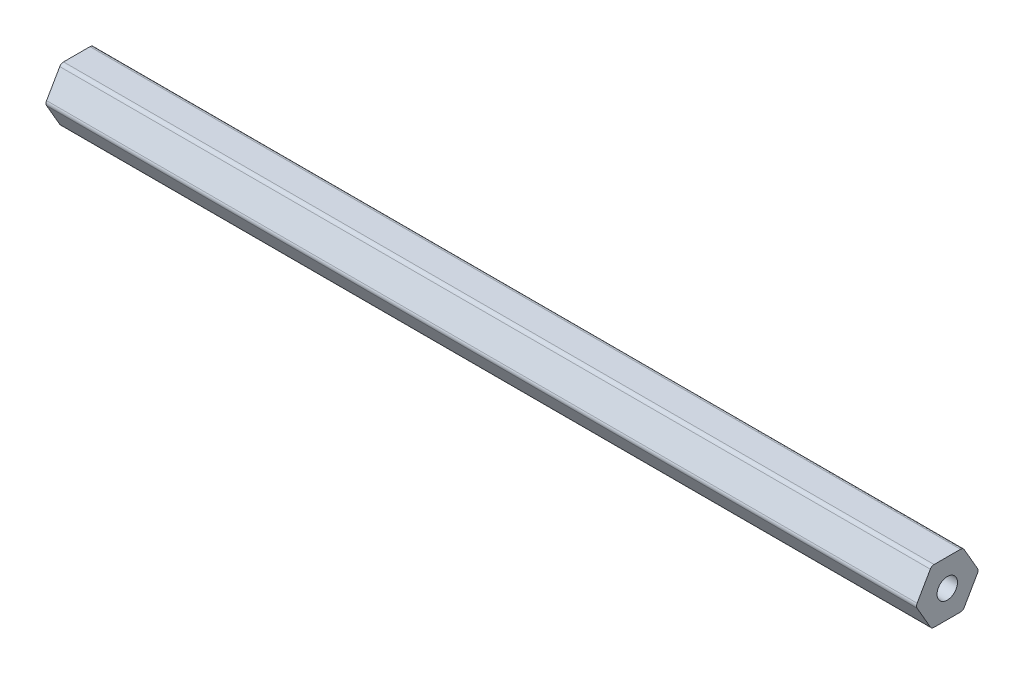
ISO-10303-21;
HEADER;
FILE_DESCRIPTION(('STEP AP214'),'2;1');
FILE_NAME('part.step','',(''),(''),'','','');
FILE_SCHEMA(('AUTOMOTIVE_DESIGN { 1 0 10303 214 1 1 1 1 }'));
ENDSEC;
DATA;
#1=APPLICATION_CONTEXT('core data for automotive mechanical design processes');
#2=APPLICATION_PROTOCOL_DEFINITION('international standard','automotive_design',2000,#1);
#3=PRODUCT_CONTEXT('',#1,'mechanical');
#4=PRODUCT('Part','Part','',(#3));
#5=PRODUCT_RELATED_PRODUCT_CATEGORY('part','',(#4));
#6=PRODUCT_DEFINITION_FORMATION('','',#4);
#7=PRODUCT_DEFINITION_CONTEXT('part definition',#1,'design');
#8=PRODUCT_DEFINITION('design','',#6,#7);
#9=PRODUCT_DEFINITION_SHAPE('','',#8);
#10=(LENGTH_UNIT() NAMED_UNIT(*) SI_UNIT(.MILLI.,.METRE.));
#11=(NAMED_UNIT(*) PLANE_ANGLE_UNIT() SI_UNIT($,.RADIAN.));
#12=(NAMED_UNIT(*) SI_UNIT($,.STERADIAN.) SOLID_ANGLE_UNIT());
#13=UNCERTAINTY_MEASURE_WITH_UNIT(LENGTH_MEASURE(1.E-05),#10,'distance_accuracy_value','');
#14=(GEOMETRIC_REPRESENTATION_CONTEXT(3) GLOBAL_UNCERTAINTY_ASSIGNED_CONTEXT((#13)) GLOBAL_UNIT_ASSIGNED_CONTEXT((#10,
#11,#12)) REPRESENTATION_CONTEXT('',''));
#15=CARTESIAN_POINT('',(0.,0.,0.));
#16=DIRECTION('',(0.,0.,1.));
#17=DIRECTION('',(1.,0.,0.));
#18=AXIS2_PLACEMENT_3D('',#15,#16,#17);
#19=CARTESIAN_POINT('',(203.2,5.334,-3.07958633585748));
#20=DIRECTION('',(-1.,0.,0.));
#21=DIRECTION('',(0.,0.,1.));
#22=AXIS2_PLACEMENT_3D('',#19,#20,#21);
#23=PLANE('',#22);
#24=CARTESIAN_POINT('',(203.2,5.334,-3.07958633585748));
#25=DIRECTION('',(1.,0.,0.));
#26=DIRECTION('',(0.,0.,1.));
#27=AXIS2_PLACEMENT_3D('',#24,#25,#26);
#28=CIRCLE('',#27,1.016);
#29=CARTESIAN_POINT('',(203.2,5.84199999999999,-3.95946814610247));
#30=VERTEX_POINT('',#29);
#31=CARTESIAN_POINT('',(203.2,6.34999999999999,-3.07958633585748));
#32=VERTEX_POINT('',#31);
#33=EDGE_CURVE('E206',#30,#32,#28,.T.);
#34=ORIENTED_EDGE('',*,*,#33,.T.);
#35=DIRECTION('',(0.,0.,1.));
#36=VECTOR('',#35,1.);
#37=CARTESIAN_POINT('',(203.2,6.34999999999999,-3.07958633585748));
#38=LINE('',#37,#36);
#39=CARTESIAN_POINT('',(203.2,6.35000000000001,3.07958633585745));
#40=VERTEX_POINT('',#39);
#41=EDGE_CURVE('E118',#32,#40,#38,.T.);
#42=ORIENTED_EDGE('',*,*,#41,.T.);
#43=CARTESIAN_POINT('',(203.2,5.33400000000001,3.07958633585745));
#44=DIRECTION('',(1.,0.,0.));
#45=DIRECTION('',(0.,0.,1.));
#46=AXIS2_PLACEMENT_3D('',#43,#44,#45);
#47=CIRCLE('',#46,1.016);
#48=CARTESIAN_POINT('',(203.2,5.84200000000001,3.95946814610244));
#49=VERTEX_POINT('',#48);
#50=EDGE_CURVE('E243',#40,#49,#47,.T.);
#51=ORIENTED_EDGE('',*,*,#50,.T.);
#52=DIRECTION('',(0.,-0.866025403784437,0.500000000000003));
#53=VECTOR('',#52,1.);
#54=CARTESIAN_POINT('',(203.2,5.84200000000001,3.95946814610244));
#55=LINE('',#54,#53);
#56=CARTESIAN_POINT('',(203.2,0.508000000000022,7.03905448195992));
#57=VERTEX_POINT('',#56);
#58=EDGE_CURVE('E263',#49,#57,#55,.T.);
#59=ORIENTED_EDGE('',*,*,#58,.T.);
#60=CARTESIAN_POINT('',(203.2,0.,6.15917267171493));
#61=DIRECTION('',(1.,0.,0.));
#62=DIRECTION('',(0.,0.,1.));
#63=AXIS2_PLACEMENT_3D('',#60,#61,#62);
#64=CIRCLE('',#63,1.016);
#65=CARTESIAN_POINT('',(203.2,-0.50799999999998,7.03905448195993));
#66=VERTEX_POINT('',#65);
#67=EDGE_CURVE('E259',#57,#66,#64,.T.);
#68=ORIENTED_EDGE('',*,*,#67,.T.);
#69=DIRECTION('',(0.,-0.86602540378444,-0.499999999999998));
#70=VECTOR('',#69,1.);
#71=CARTESIAN_POINT('',(203.2,-0.507999999999979,7.03905448195992));
#72=LINE('',#71,#70);
#73=CARTESIAN_POINT('',(203.2,-5.84199999999999,3.95946814610247));
#74=VERTEX_POINT('',#73);
#75=EDGE_CURVE('E262',#66,#74,#72,.T.);
#76=ORIENTED_EDGE('',*,*,#75,.T.);
#77=CARTESIAN_POINT('',(203.2,-5.334,3.07958633585748));
#78=DIRECTION('',(1.,0.,0.));
#79=DIRECTION('',(0.,0.,1.));
#80=AXIS2_PLACEMENT_3D('',#77,#78,#79);
#81=CIRCLE('',#80,1.016);
#82=CARTESIAN_POINT('',(203.2,-6.35,3.07958633585748));
#83=VERTEX_POINT('',#82);
#84=EDGE_CURVE('E267',#74,#83,#81,.T.);
#85=ORIENTED_EDGE('',*,*,#84,.T.);
#86=DIRECTION('',(0.,0.,-1.));
#87=VECTOR('',#86,1.);
#88=CARTESIAN_POINT('',(203.2,-6.35,3.07958633585748));
#89=LINE('',#88,#87);
#90=CARTESIAN_POINT('',(203.2,-6.35000000000001,-3.07958633585745));
#91=VERTEX_POINT('',#90);
#92=EDGE_CURVE('E274',#83,#91,#89,.T.);
#93=ORIENTED_EDGE('',*,*,#92,.T.);
#94=CARTESIAN_POINT('',(203.2,-5.33400000000001,-3.07958633585745));
#95=DIRECTION('',(1.,0.,0.));
#96=DIRECTION('',(0.,0.,1.));
#97=AXIS2_PLACEMENT_3D('',#94,#95,#96);
#98=CIRCLE('',#97,1.016);
#99=CARTESIAN_POINT('',(203.2,-5.84200000000001,-3.95946814610244));
#100=VERTEX_POINT('',#99);
#101=EDGE_CURVE('E149',#91,#100,#98,.T.);
#102=ORIENTED_EDGE('',*,*,#101,.T.);
#103=DIRECTION('',(0.,0.866025403784437,-0.500000000000002));
#104=VECTOR('',#103,1.);
#105=CARTESIAN_POINT('',(203.2,-5.84200000000001,-3.95946814610244));
#106=LINE('',#105,#104);
#107=CARTESIAN_POINT('',(203.2,-0.508000000000019,-7.03905448195992));
#108=VERTEX_POINT('',#107);
#109=EDGE_CURVE('E143',#100,#108,#106,.T.);
#110=ORIENTED_EDGE('',*,*,#109,.T.);
#111=CARTESIAN_POINT('',(203.2,0.,-6.15917267171493));
#112=DIRECTION('',(1.,0.,0.));
#113=DIRECTION('',(0.,0.,1.));
#114=AXIS2_PLACEMENT_3D('',#111,#112,#113);
#115=CIRCLE('',#114,1.016);
#116=CARTESIAN_POINT('',(203.2,0.507999999999981,-7.03905448195992));
#117=VERTEX_POINT('',#116);
#118=EDGE_CURVE('E147',#108,#117,#115,.T.);
#119=ORIENTED_EDGE('',*,*,#118,.T.);
#120=DIRECTION('',(0.,0.86602540378444,0.499999999999997));
#121=VECTOR('',#120,1.);
#122=CARTESIAN_POINT('',(203.2,0.50799999999998,-7.03905448195992));
#123=LINE('',#122,#121);
#124=EDGE_CURVE('E63',#117,#30,#123,.T.);
#125=ORIENTED_EDGE('',*,*,#124,.T.);
#126=EDGE_LOOP('',(#34,#42,#51,#59,#68,#76,#85,#93,#102,#110,#119,#125));
#127=FACE_BOUND('',#126,.T.);
#128=CARTESIAN_POINT('',(203.2,0.,0.));
#129=DIRECTION('',(1.,0.,0.));
#130=DIRECTION('',(0.,0.,-1.));
#131=AXIS2_PLACEMENT_3D('',#128,#129,#130);
#132=CIRCLE('',#131,2.38125);
#133=CARTESIAN_POINT('',(203.2,0.,-2.38125));
#134=VERTEX_POINT('',#133);
#135=EDGE_CURVE('E176',#134,#134,#132,.T.);
#136=ORIENTED_EDGE('',*,*,#135,.F.);
#137=EDGE_LOOP('',(#136));
#138=FACE_BOUND('',#137,.T.);
#139=ADVANCED_FACE('F45',(#127,#138),#23,.F.);
#140=CARTESIAN_POINT('',(0.,5.334,-3.07958633585748));
#141=DIRECTION('',(-1.,0.,0.));
#142=DIRECTION('',(0.,0.,1.));
#143=AXIS2_PLACEMENT_3D('',#140,#141,#142);
#144=PLANE('',#143);
#145=CARTESIAN_POINT('',(0.,5.334,-3.07958633585748));
#146=DIRECTION('',(1.,0.,0.));
#147=DIRECTION('',(0.,0.,1.));
#148=AXIS2_PLACEMENT_3D('',#145,#146,#147);
#149=CIRCLE('',#148,1.016);
#150=CARTESIAN_POINT('',(0.,5.84199999999999,-3.95946814610247));
#151=VERTEX_POINT('',#150);
#152=CARTESIAN_POINT('',(0.,6.34999999999999,-3.07958633585748));
#153=VERTEX_POINT('',#152);
#154=EDGE_CURVE('E171',#151,#153,#149,.T.);
#155=ORIENTED_EDGE('',*,*,#154,.F.);
#156=DIRECTION('',(0.,0.86602540378444,0.499999999999997));
#157=VECTOR('',#156,1.);
#158=CARTESIAN_POINT('',(0.,0.50799999999998,-7.03905448195992));
#159=LINE('',#158,#157);
#160=CARTESIAN_POINT('',(0.,0.507999999999981,-7.03905448195992));
#161=VERTEX_POINT('',#160);
#162=EDGE_CURVE('E110',#161,#151,#159,.T.);
#163=ORIENTED_EDGE('',*,*,#162,.F.);
#164=CARTESIAN_POINT('',(0.,0.,-6.15917267171493));
#165=DIRECTION('',(1.,0.,0.));
#166=DIRECTION('',(0.,0.,1.));
#167=AXIS2_PLACEMENT_3D('',#164,#165,#166);
#168=CIRCLE('',#167,1.016);
#169=CARTESIAN_POINT('',(0.,-0.508000000000019,-7.03905448195992));
#170=VERTEX_POINT('',#169);
#171=EDGE_CURVE('E104',#170,#161,#168,.T.);
#172=ORIENTED_EDGE('',*,*,#171,.F.);
#173=DIRECTION('',(0.,0.866025403784437,-0.500000000000002));
#174=VECTOR('',#173,1.);
#175=CARTESIAN_POINT('',(0.,-5.84200000000001,-3.95946814610244));
#176=LINE('',#175,#174);
#177=CARTESIAN_POINT('',(0.,-5.84200000000001,-3.95946814610244));
#178=VERTEX_POINT('',#177);
#179=EDGE_CURVE('E158',#178,#170,#176,.T.);
#180=ORIENTED_EDGE('',*,*,#179,.F.);
#181=CARTESIAN_POINT('',(0.,-5.33400000000001,-3.07958633585745));
#182=DIRECTION('',(1.,0.,0.));
#183=DIRECTION('',(0.,0.,1.));
#184=AXIS2_PLACEMENT_3D('',#181,#182,#183);
#185=CIRCLE('',#184,1.016);
#186=CARTESIAN_POINT('',(0.,-6.35000000000001,-3.07958633585745));
#187=VERTEX_POINT('',#186);
#188=EDGE_CURVE('E197',#187,#178,#185,.T.);
#189=ORIENTED_EDGE('',*,*,#188,.F.);
#190=DIRECTION('',(0.,0.,-1.));
#191=VECTOR('',#190,1.);
#192=CARTESIAN_POINT('',(0.,-6.35,3.07958633585748));
#193=LINE('',#192,#191);
#194=CARTESIAN_POINT('',(0.,-6.35,3.07958633585748));
#195=VERTEX_POINT('',#194);
#196=EDGE_CURVE('E194',#195,#187,#193,.T.);
#197=ORIENTED_EDGE('',*,*,#196,.F.);
#198=CARTESIAN_POINT('',(0.,-5.334,3.07958633585748));
#199=DIRECTION('',(1.,0.,0.));
#200=DIRECTION('',(0.,0.,1.));
#201=AXIS2_PLACEMENT_3D('',#198,#199,#200);
#202=CIRCLE('',#201,1.016);
#203=CARTESIAN_POINT('',(0.,-5.84199999999999,3.95946814610247));
#204=VERTEX_POINT('',#203);
#205=EDGE_CURVE('E191',#204,#195,#202,.T.);
#206=ORIENTED_EDGE('',*,*,#205,.F.);
#207=DIRECTION('',(0.,-0.86602540378444,-0.499999999999998));
#208=VECTOR('',#207,1.);
#209=CARTESIAN_POINT('',(0.,-0.507999999999979,7.03905448195992));
#210=LINE('',#209,#208);
#211=CARTESIAN_POINT('',(0.,-0.50799999999998,7.03905448195993));
#212=VERTEX_POINT('',#211);
#213=EDGE_CURVE('E188',#212,#204,#210,.T.);
#214=ORIENTED_EDGE('',*,*,#213,.F.);
#215=CARTESIAN_POINT('',(0.,0.,6.15917267171493));
#216=DIRECTION('',(1.,0.,0.));
#217=DIRECTION('',(0.,0.,1.));
#218=AXIS2_PLACEMENT_3D('',#215,#216,#217);
#219=CIRCLE('',#218,1.016);
#220=CARTESIAN_POINT('',(0.,0.508000000000022,7.03905448195992));
#221=VERTEX_POINT('',#220);
#222=EDGE_CURVE('E185',#221,#212,#219,.T.);
#223=ORIENTED_EDGE('',*,*,#222,.F.);
#224=DIRECTION('',(0.,-0.866025403784437,0.500000000000003));
#225=VECTOR('',#224,1.);
#226=CARTESIAN_POINT('',(0.,5.84200000000001,3.95946814610244));
#227=LINE('',#226,#225);
#228=CARTESIAN_POINT('',(0.,5.84200000000001,3.95946814610244));
#229=VERTEX_POINT('',#228);
#230=EDGE_CURVE('E182',#229,#221,#227,.T.);
#231=ORIENTED_EDGE('',*,*,#230,.F.);
#232=CARTESIAN_POINT('',(0.,5.33400000000001,3.07958633585745));
#233=DIRECTION('',(1.,0.,0.));
#234=DIRECTION('',(0.,0.,1.));
#235=AXIS2_PLACEMENT_3D('',#232,#233,#234);
#236=CIRCLE('',#235,1.016);
#237=CARTESIAN_POINT('',(0.,6.35000000000001,3.07958633585745));
#238=VERTEX_POINT('',#237);
#239=EDGE_CURVE('E179',#238,#229,#236,.T.);
#240=ORIENTED_EDGE('',*,*,#239,.F.);
#241=DIRECTION('',(0.,0.,1.));
#242=VECTOR('',#241,1.);
#243=CARTESIAN_POINT('',(0.,6.34999999999999,-3.07958633585748));
#244=LINE('',#243,#242);
#245=EDGE_CURVE('E175',#153,#238,#244,.T.);
#246=ORIENTED_EDGE('',*,*,#245,.F.);
#247=EDGE_LOOP('',(#155,#163,#172,#180,#189,#197,#206,#214,#223,#231,#240,#246));
#248=FACE_BOUND('',#247,.T.);
#249=CARTESIAN_POINT('',(0.,0.,0.));
#250=DIRECTION('',(1.,0.,0.));
#251=DIRECTION('',(0.,0.,-1.));
#252=AXIS2_PLACEMENT_3D('',#249,#250,#251);
#253=CIRCLE('',#252,2.38125);
#254=CARTESIAN_POINT('',(0.,0.,-2.38125));
#255=VERTEX_POINT('',#254);
#256=EDGE_CURVE('E474',#255,#255,#253,.T.);
#257=ORIENTED_EDGE('',*,*,#256,.T.);
#258=EDGE_LOOP('',(#257));
#259=FACE_BOUND('',#258,.T.);
#260=ADVANCED_FACE('F247',(#248,#259),#144,.T.);
#261=CARTESIAN_POINT('',(203.2,5.334,-3.07958633585748));
#262=DIRECTION('',(-1.,0.,0.));
#263=DIRECTION('',(0.,0.,1.));
#264=AXIS2_PLACEMENT_3D('',#261,#262,#263);
#265=CYLINDRICAL_SURFACE('',#264,1.016);
#266=ORIENTED_EDGE('',*,*,#154,.T.);
#267=DIRECTION('',(-1.,0.,0.));
#268=VECTOR('',#267,1.);
#269=CARTESIAN_POINT('',(203.2,6.34999999999999,-3.07958633585748));
#270=LINE('',#269,#268);
#271=EDGE_CURVE('E11',#32,#153,#270,.T.);
#272=ORIENTED_EDGE('',*,*,#271,.F.);
#273=ORIENTED_EDGE('',*,*,#33,.F.);
#274=DIRECTION('',(-1.,0.,0.));
#275=VECTOR('',#274,1.);
#276=CARTESIAN_POINT('',(203.2,5.84199999999999,-3.95946814610247));
#277=LINE('',#276,#275);
#278=EDGE_CURVE('E167',#30,#151,#277,.T.);
#279=ORIENTED_EDGE('',*,*,#278,.T.);
#280=EDGE_LOOP('',(#266,#272,#273,#279));
#281=FACE_BOUND('',#280,.T.);
#282=ADVANCED_FACE('F47',(#281),#265,.T.);
#283=CARTESIAN_POINT('',(203.2,6.34999999999999,-3.07958633585748));
#284=DIRECTION('',(0.,-1.,0.));
#285=DIRECTION('',(0.,0.,-1.));
#286=AXIS2_PLACEMENT_3D('',#283,#284,#285);
#287=PLANE('',#286);
#288=ORIENTED_EDGE('',*,*,#245,.T.);
#289=DIRECTION('',(-1.,0.,0.));
#290=VECTOR('',#289,1.);
#291=CARTESIAN_POINT('',(203.2,6.35000000000001,3.07958633585745));
#292=LINE('',#291,#290);
#293=EDGE_CURVE('E55',#40,#238,#292,.T.);
#294=ORIENTED_EDGE('',*,*,#293,.F.);
#295=ORIENTED_EDGE('',*,*,#41,.F.);
#296=ORIENTED_EDGE('',*,*,#271,.T.);
#297=EDGE_LOOP('',(#288,#294,#295,#296));
#298=FACE_BOUND('',#297,.T.);
#299=ADVANCED_FACE('F310',(#298),#287,.F.);
#300=CARTESIAN_POINT('',(203.2,5.33400000000001,3.07958633585745));
#301=DIRECTION('',(-1.,0.,0.));
#302=DIRECTION('',(0.,0.,1.));
#303=AXIS2_PLACEMENT_3D('',#300,#301,#302);
#304=CYLINDRICAL_SURFACE('',#303,1.016);
#305=ORIENTED_EDGE('',*,*,#239,.T.);
#306=DIRECTION('',(-1.,0.,0.));
#307=VECTOR('',#306,1.);
#308=CARTESIAN_POINT('',(203.2,5.84200000000001,3.95946814610244));
#309=LINE('',#308,#307);
#310=EDGE_CURVE('E233',#49,#229,#309,.T.);
#311=ORIENTED_EDGE('',*,*,#310,.F.);
#312=ORIENTED_EDGE('',*,*,#50,.F.);
#313=ORIENTED_EDGE('',*,*,#293,.T.);
#314=EDGE_LOOP('',(#305,#311,#312,#313));
#315=FACE_BOUND('',#314,.T.);
#316=ADVANCED_FACE('F241',(#315),#304,.T.);
#317=CARTESIAN_POINT('',(203.2,5.84200000000001,3.95946814610244));
#318=DIRECTION('',(0.,-0.500000000000003,-0.866025403784437));
#319=DIRECTION('',(0.,0.866025403784437,-0.500000000000003));
#320=AXIS2_PLACEMENT_3D('',#317,#318,#319);
#321=PLANE('',#320);
#322=ORIENTED_EDGE('',*,*,#230,.T.);
#323=DIRECTION('',(-1.,0.,0.));
#324=VECTOR('',#323,1.);
#325=CARTESIAN_POINT('',(203.2,0.508000000000022,7.03905448195992));
#326=LINE('',#325,#324);
#327=EDGE_CURVE('E229',#57,#221,#326,.T.);
#328=ORIENTED_EDGE('',*,*,#327,.F.);
#329=ORIENTED_EDGE('',*,*,#58,.F.);
#330=ORIENTED_EDGE('',*,*,#310,.T.);
#331=EDGE_LOOP('',(#322,#328,#329,#330));
#332=FACE_BOUND('',#331,.T.);
#333=ADVANCED_FACE('F253',(#332),#321,.F.);
#334=CARTESIAN_POINT('',(203.2,0.,6.15917267171493));
#335=DIRECTION('',(-1.,0.,0.));
#336=DIRECTION('',(0.,0.,1.));
#337=AXIS2_PLACEMENT_3D('',#334,#335,#336);
#338=CYLINDRICAL_SURFACE('',#337,1.016);
#339=ORIENTED_EDGE('',*,*,#222,.T.);
#340=DIRECTION('',(-1.,0.,0.));
#341=VECTOR('',#340,1.);
#342=CARTESIAN_POINT('',(203.2,-0.50799999999998,7.03905448195993));
#343=LINE('',#342,#341);
#344=EDGE_CURVE('E225',#66,#212,#343,.T.);
#345=ORIENTED_EDGE('',*,*,#344,.F.);
#346=ORIENTED_EDGE('',*,*,#67,.F.);
#347=ORIENTED_EDGE('',*,*,#327,.T.);
#348=EDGE_LOOP('',(#339,#345,#346,#347));
#349=FACE_BOUND('',#348,.T.);
#350=ADVANCED_FACE('F257',(#349),#338,.T.);
#351=CARTESIAN_POINT('',(203.2,-0.507999999999979,7.03905448195992));
#352=DIRECTION('',(0.,0.499999999999998,-0.86602540378444));
#353=DIRECTION('',(0.,0.86602540378444,0.499999999999998));
#354=AXIS2_PLACEMENT_3D('',#351,#352,#353);
#355=PLANE('',#354);
#356=ORIENTED_EDGE('',*,*,#213,.T.);
#357=DIRECTION('',(-1.,0.,0.));
#358=VECTOR('',#357,1.);
#359=CARTESIAN_POINT('',(203.2,-5.84199999999999,3.95946814610247));
#360=LINE('',#359,#358);
#361=EDGE_CURVE('E221',#74,#204,#360,.T.);
#362=ORIENTED_EDGE('',*,*,#361,.F.);
#363=ORIENTED_EDGE('',*,*,#75,.F.);
#364=ORIENTED_EDGE('',*,*,#344,.T.);
#365=EDGE_LOOP('',(#356,#362,#363,#364));
#366=FACE_BOUND('',#365,.T.);
#367=ADVANCED_FACE('F323',(#366),#355,.F.);
#368=CARTESIAN_POINT('',(203.2,-5.334,3.07958633585748));
#369=DIRECTION('',(-1.,0.,0.));
#370=DIRECTION('',(0.,0.,1.));
#371=AXIS2_PLACEMENT_3D('',#368,#369,#370);
#372=CYLINDRICAL_SURFACE('',#371,1.016);
#373=ORIENTED_EDGE('',*,*,#205,.T.);
#374=DIRECTION('',(-1.,0.,0.));
#375=VECTOR('',#374,1.);
#376=CARTESIAN_POINT('',(203.2,-6.35,3.07958633585748));
#377=LINE('',#376,#375);
#378=EDGE_CURVE('E217',#83,#195,#377,.T.);
#379=ORIENTED_EDGE('',*,*,#378,.F.);
#380=ORIENTED_EDGE('',*,*,#84,.F.);
#381=ORIENTED_EDGE('',*,*,#361,.T.);
#382=EDGE_LOOP('',(#373,#379,#380,#381));
#383=FACE_BOUND('',#382,.T.);
#384=ADVANCED_FACE('F326',(#383),#372,.T.);
#385=CARTESIAN_POINT('',(203.2,-6.35,3.07958633585748));
#386=DIRECTION('',(0.,1.,0.));
#387=DIRECTION('',(0.,0.,1.));
#388=AXIS2_PLACEMENT_3D('',#385,#386,#387);
#389=PLANE('',#388);
#390=ORIENTED_EDGE('',*,*,#196,.T.);
#391=DIRECTION('',(-1.,0.,0.));
#392=VECTOR('',#391,1.);
#393=CARTESIAN_POINT('',(203.2,-6.35000000000001,-3.07958633585745));
#394=LINE('',#393,#392);
#395=EDGE_CURVE('E213',#91,#187,#394,.T.);
#396=ORIENTED_EDGE('',*,*,#395,.F.);
#397=ORIENTED_EDGE('',*,*,#92,.F.);
#398=ORIENTED_EDGE('',*,*,#378,.T.);
#399=EDGE_LOOP('',(#390,#396,#397,#398));
#400=FACE_BOUND('',#399,.T.);
#401=ADVANCED_FACE('F282',(#400),#389,.F.);
#402=CARTESIAN_POINT('',(203.2,-5.33400000000001,-3.07958633585745));
#403=DIRECTION('',(-1.,0.,0.));
#404=DIRECTION('',(0.,0.,1.));
#405=AXIS2_PLACEMENT_3D('',#402,#403,#404);
#406=CYLINDRICAL_SURFACE('',#405,1.016);
#407=ORIENTED_EDGE('',*,*,#188,.T.);
#408=DIRECTION('',(-1.,0.,0.));
#409=VECTOR('',#408,1.);
#410=CARTESIAN_POINT('',(203.2,-5.84200000000001,-3.95946814610244));
#411=LINE('',#410,#409);
#412=EDGE_CURVE('E160',#100,#178,#411,.T.);
#413=ORIENTED_EDGE('',*,*,#412,.F.);
#414=ORIENTED_EDGE('',*,*,#101,.F.);
#415=ORIENTED_EDGE('',*,*,#395,.T.);
#416=EDGE_LOOP('',(#407,#413,#414,#415));
#417=FACE_BOUND('',#416,.T.);
#418=ADVANCED_FACE('F286',(#417),#406,.T.);
#419=CARTESIAN_POINT('',(203.2,-5.84200000000001,-3.95946814610244));
#420=DIRECTION('',(0.,0.500000000000002,0.866025403784437));
#421=DIRECTION('',(0.,-0.866025403784437,0.500000000000002));
#422=AXIS2_PLACEMENT_3D('',#419,#420,#421);
#423=PLANE('',#422);
#424=ORIENTED_EDGE('',*,*,#179,.T.);
#425=DIRECTION('',(-1.,0.,0.));
#426=VECTOR('',#425,1.);
#427=CARTESIAN_POINT('',(203.2,-0.508000000000019,-7.03905448195992));
#428=LINE('',#427,#426);
#429=EDGE_CURVE('E155',#108,#170,#428,.T.);
#430=ORIENTED_EDGE('',*,*,#429,.F.);
#431=ORIENTED_EDGE('',*,*,#109,.F.);
#432=ORIENTED_EDGE('',*,*,#412,.T.);
#433=EDGE_LOOP('',(#424,#430,#431,#432));
#434=FACE_BOUND('',#433,.T.);
#435=ADVANCED_FACE('F156',(#434),#423,.F.);
#436=CARTESIAN_POINT('',(203.2,0.,-6.15917267171493));
#437=DIRECTION('',(-1.,0.,0.));
#438=DIRECTION('',(0.,0.,1.));
#439=AXIS2_PLACEMENT_3D('',#436,#437,#438);
#440=CYLINDRICAL_SURFACE('',#439,1.016);
#441=ORIENTED_EDGE('',*,*,#171,.T.);
#442=DIRECTION('',(-1.,0.,0.));
#443=VECTOR('',#442,1.);
#444=CARTESIAN_POINT('',(203.2,0.507999999999981,-7.03905448195992));
#445=LINE('',#444,#443);
#446=EDGE_CURVE('E161',#117,#161,#445,.T.);
#447=ORIENTED_EDGE('',*,*,#446,.F.);
#448=ORIENTED_EDGE('',*,*,#118,.F.);
#449=ORIENTED_EDGE('',*,*,#429,.T.);
#450=EDGE_LOOP('',(#441,#447,#448,#449));
#451=FACE_BOUND('',#450,.T.);
#452=ADVANCED_FACE('F163',(#451),#440,.T.);
#453=CARTESIAN_POINT('',(203.2,0.50799999999998,-7.03905448195992));
#454=DIRECTION('',(0.,-0.499999999999997,0.86602540378444));
#455=DIRECTION('',(0.,-0.86602540378444,-0.499999999999998));
#456=AXIS2_PLACEMENT_3D('',#453,#454,#455);
#457=PLANE('',#456);
#458=ORIENTED_EDGE('',*,*,#162,.T.);
#459=ORIENTED_EDGE('',*,*,#278,.F.);
#460=ORIENTED_EDGE('',*,*,#124,.F.);
#461=ORIENTED_EDGE('',*,*,#446,.T.);
#462=EDGE_LOOP('',(#458,#459,#460,#461));
#463=FACE_BOUND('',#462,.T.);
#464=ADVANCED_FACE('F290',(#463),#457,.F.);
#465=CARTESIAN_POINT('',(203.2,0.,0.));
#466=DIRECTION('',(-1.,0.,0.));
#467=DIRECTION('',(0.,0.,1.));
#468=AXIS2_PLACEMENT_3D('',#465,#466,#467);
#469=CYLINDRICAL_SURFACE('',#468,2.38125);
#470=ORIENTED_EDGE('',*,*,#135,.T.);
#471=EDGE_LOOP('',(#470));
#472=FACE_BOUND('',#471,.T.);
#473=ORIENTED_EDGE('',*,*,#256,.F.);
#474=EDGE_LOOP('',(#473));
#475=FACE_BOUND('',#474,.T.);
#476=ADVANCED_FACE('F292',(#472,#475),#469,.F.);
#477=CLOSED_SHELL('',(#139,#260,#282,#299,#316,#333,#350,#367,#384,#401,#418,#435,#452,#464,#476));
#478=MANIFOLD_SOLID_BREP('B2',#477);
#479=ADVANCED_BREP_SHAPE_REPRESENTATION('',(#18,#478),#14);
#480=SHAPE_DEFINITION_REPRESENTATION(#9,#479);
ENDSEC;
END-ISO-10303-21;
